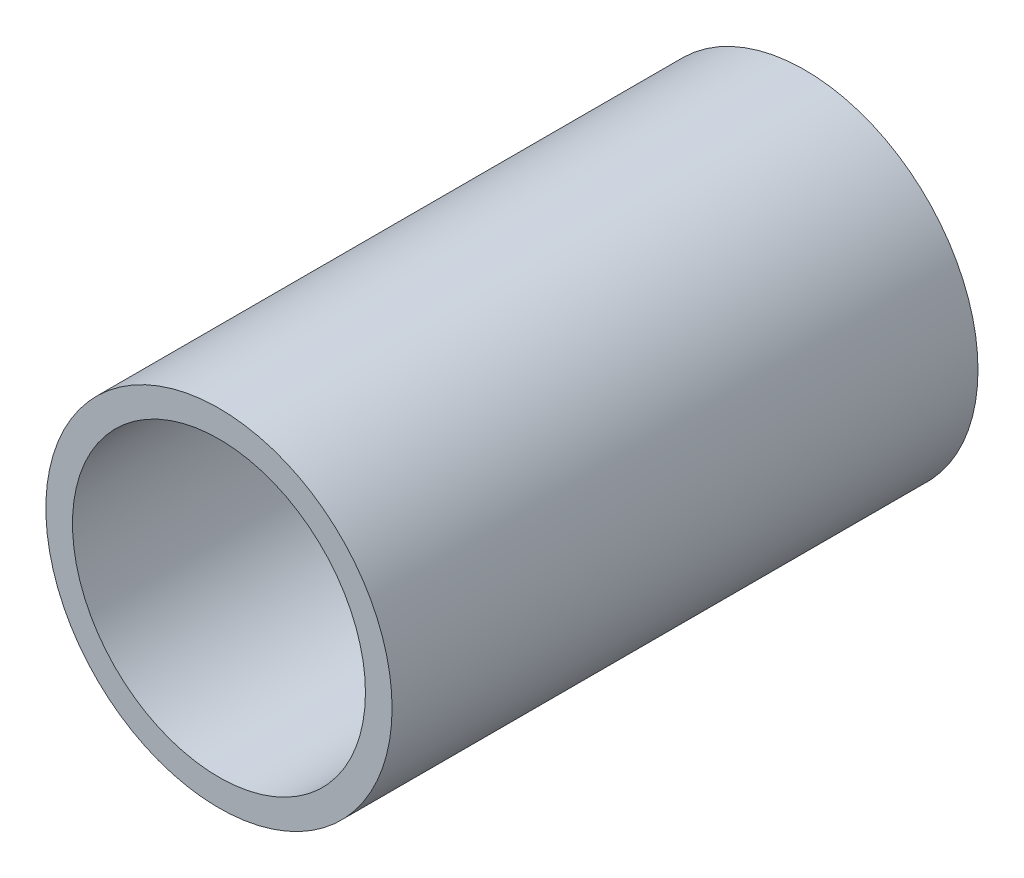
ISO-10303-21;
HEADER;
FILE_DESCRIPTION(('STEP AP214'),'2;1');
FILE_NAME('part.step','',(''),(''),'','','');
FILE_SCHEMA(('AUTOMOTIVE_DESIGN { 1 0 10303 214 1 1 1 1 }'));
ENDSEC;
DATA;
#1=APPLICATION_CONTEXT('core data for automotive mechanical design processes');
#2=APPLICATION_PROTOCOL_DEFINITION('international standard','automotive_design',2000,#1);
#3=PRODUCT_CONTEXT('',#1,'mechanical');
#4=PRODUCT('Part','Part','',(#3));
#5=PRODUCT_RELATED_PRODUCT_CATEGORY('part','',(#4));
#6=PRODUCT_DEFINITION_FORMATION('','',#4);
#7=PRODUCT_DEFINITION_CONTEXT('part definition',#1,'design');
#8=PRODUCT_DEFINITION('design','',#6,#7);
#9=PRODUCT_DEFINITION_SHAPE('','',#8);
#10=(LENGTH_UNIT() NAMED_UNIT(*) SI_UNIT(.MILLI.,.METRE.));
#11=(NAMED_UNIT(*) PLANE_ANGLE_UNIT() SI_UNIT($,.RADIAN.));
#12=(NAMED_UNIT(*) SI_UNIT($,.STERADIAN.) SOLID_ANGLE_UNIT());
#13=UNCERTAINTY_MEASURE_WITH_UNIT(LENGTH_MEASURE(1.E-05),#10,'distance_accuracy_value','');
#14=(GEOMETRIC_REPRESENTATION_CONTEXT(3) GLOBAL_UNCERTAINTY_ASSIGNED_CONTEXT((#13)) GLOBAL_UNIT_ASSIGNED_CONTEXT((#10,
#11,#12)) REPRESENTATION_CONTEXT('',''));
#15=CARTESIAN_POINT('',(0.,0.,0.));
#16=DIRECTION('',(0.,0.,1.));
#17=DIRECTION('',(1.,0.,0.));
#18=AXIS2_PLACEMENT_3D('',#15,#16,#17);
#19=CARTESIAN_POINT('',(0.,0.,11.));
#20=DIRECTION('',(0.,0.,1.));
#21=DIRECTION('',(1.,0.,0.));
#22=AXIS2_PLACEMENT_3D('',#19,#20,#21);
#23=PLANE('',#22);
#24=CARTESIAN_POINT('',(0.,0.,11.));
#25=DIRECTION('',(0.,0.,1.));
#26=DIRECTION('',(1.,0.,0.));
#27=AXIS2_PLACEMENT_3D('',#24,#25,#26);
#28=CIRCLE('',#27,3.25);
#29=CARTESIAN_POINT('',(3.25,0.,11.));
#30=VERTEX_POINT('',#29);
#31=EDGE_CURVE('E10',#30,#30,#28,.T.);
#32=ORIENTED_EDGE('',*,*,#31,.T.);
#33=EDGE_LOOP('',(#32));
#34=FACE_BOUND('',#33,.T.);
#35=CARTESIAN_POINT('',(0.,0.,11.));
#36=DIRECTION('',(0.,0.,1.));
#37=DIRECTION('',(1.,0.,0.));
#38=AXIS2_PLACEMENT_3D('',#35,#36,#37);
#39=CIRCLE('',#38,2.75);
#40=CARTESIAN_POINT('',(2.75,0.,11.));
#41=VERTEX_POINT('',#40);
#42=EDGE_CURVE('E55',#41,#41,#39,.T.);
#43=ORIENTED_EDGE('',*,*,#42,.F.);
#44=EDGE_LOOP('',(#43));
#45=FACE_BOUND('',#44,.T.);
#46=ADVANCED_FACE('F42',(#34,#45),#23,.T.);
#47=CARTESIAN_POINT('',(0.,0.,0.));
#48=DIRECTION('',(0.,0.,1.));
#49=DIRECTION('',(1.,0.,0.));
#50=AXIS2_PLACEMENT_3D('',#47,#48,#49);
#51=PLANE('',#50);
#52=CARTESIAN_POINT('',(0.,0.,0.));
#53=DIRECTION('',(0.,0.,1.));
#54=DIRECTION('',(1.,0.,0.));
#55=AXIS2_PLACEMENT_3D('',#52,#53,#54);
#56=CIRCLE('',#55,3.25);
#57=CARTESIAN_POINT('',(3.25,0.,0.));
#58=VERTEX_POINT('',#57);
#59=EDGE_CURVE('E46',#58,#58,#56,.T.);
#60=ORIENTED_EDGE('',*,*,#59,.F.);
#61=EDGE_LOOP('',(#60));
#62=FACE_BOUND('',#61,.T.);
#63=CARTESIAN_POINT('',(0.,0.,0.));
#64=DIRECTION('',(0.,0.,1.));
#65=DIRECTION('',(1.,0.,0.));
#66=AXIS2_PLACEMENT_3D('',#63,#64,#65);
#67=CIRCLE('',#66,2.75);
#68=CARTESIAN_POINT('',(2.75,0.,0.));
#69=VERTEX_POINT('',#68);
#70=EDGE_CURVE('E57',#69,#69,#67,.T.);
#71=ORIENTED_EDGE('',*,*,#70,.T.);
#72=EDGE_LOOP('',(#71));
#73=FACE_BOUND('',#72,.T.);
#74=ADVANCED_FACE('F69',(#62,#73),#51,.F.);
#75=CARTESIAN_POINT('',(0.,0.,11.));
#76=DIRECTION('',(0.,0.,-1.));
#77=DIRECTION('',(-1.,0.,0.));
#78=AXIS2_PLACEMENT_3D('',#75,#76,#77);
#79=CYLINDRICAL_SURFACE('',#78,3.25);
#80=ORIENTED_EDGE('',*,*,#31,.F.);
#81=EDGE_LOOP('',(#80));
#82=FACE_BOUND('',#81,.T.);
#83=ORIENTED_EDGE('',*,*,#59,.T.);
#84=EDGE_LOOP('',(#83));
#85=FACE_BOUND('',#84,.T.);
#86=ADVANCED_FACE('F44',(#82,#85),#79,.T.);
#87=CARTESIAN_POINT('',(0.,0.,11.));
#88=DIRECTION('',(0.,0.,-1.));
#89=DIRECTION('',(-1.,0.,0.));
#90=AXIS2_PLACEMENT_3D('',#87,#88,#89);
#91=CYLINDRICAL_SURFACE('',#90,2.75);
#92=ORIENTED_EDGE('',*,*,#42,.T.);
#93=EDGE_LOOP('',(#92));
#94=FACE_BOUND('',#93,.T.);
#95=ORIENTED_EDGE('',*,*,#70,.F.);
#96=EDGE_LOOP('',(#95));
#97=FACE_BOUND('',#96,.T.);
#98=ADVANCED_FACE('F65',(#94,#97),#91,.F.);
#99=CLOSED_SHELL('',(#46,#74,#86,#98));
#100=MANIFOLD_SOLID_BREP('B2',#99);
#101=ADVANCED_BREP_SHAPE_REPRESENTATION('',(#18,#100),#14);
#102=SHAPE_DEFINITION_REPRESENTATION(#9,#101);
ENDSEC;
END-ISO-10303-21;
